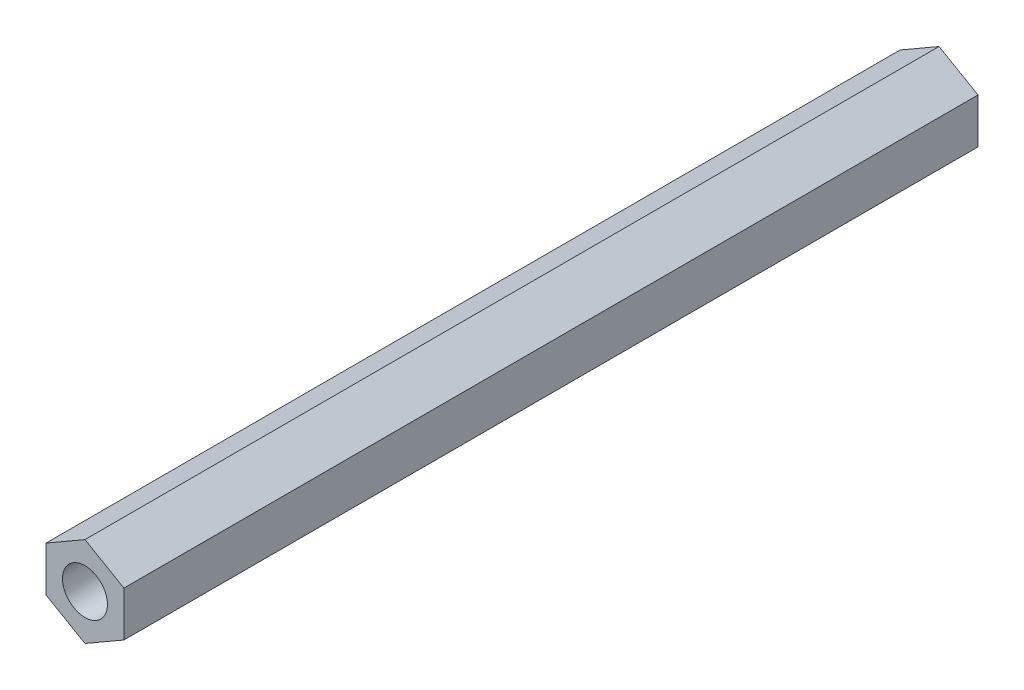
ISO-10303-21;
HEADER;
FILE_DESCRIPTION(('STEP AP214'),'2;1');
FILE_NAME('part.step','',(''),(''),'','','');
FILE_SCHEMA(('AUTOMOTIVE_DESIGN { 1 0 10303 214 1 1 1 1 }'));
ENDSEC;
DATA;
#1=APPLICATION_CONTEXT('core data for automotive mechanical design processes');
#2=APPLICATION_PROTOCOL_DEFINITION('international standard','automotive_design',2000,#1);
#3=PRODUCT_CONTEXT('',#1,'mechanical');
#4=PRODUCT('Part','Part','',(#3));
#5=PRODUCT_RELATED_PRODUCT_CATEGORY('part','',(#4));
#6=PRODUCT_DEFINITION_FORMATION('','',#4);
#7=PRODUCT_DEFINITION_CONTEXT('part definition',#1,'design');
#8=PRODUCT_DEFINITION('design','',#6,#7);
#9=PRODUCT_DEFINITION_SHAPE('','',#8);
#10=(LENGTH_UNIT() NAMED_UNIT(*) SI_UNIT(.MILLI.,.METRE.));
#11=(NAMED_UNIT(*) PLANE_ANGLE_UNIT() SI_UNIT($,.RADIAN.));
#12=(NAMED_UNIT(*) SI_UNIT($,.STERADIAN.) SOLID_ANGLE_UNIT());
#13=UNCERTAINTY_MEASURE_WITH_UNIT(LENGTH_MEASURE(1.E-05),#10,'distance_accuracy_value','');
#14=(GEOMETRIC_REPRESENTATION_CONTEXT(3) GLOBAL_UNCERTAINTY_ASSIGNED_CONTEXT((#13)) GLOBAL_UNIT_ASSIGNED_CONTEXT((#10,
#11,#12)) REPRESENTATION_CONTEXT('',''));
#15=CARTESIAN_POINT('',(0.,0.,0.));
#16=DIRECTION('',(0.,0.,1.));
#17=DIRECTION('',(1.,0.,0.));
#18=AXIS2_PLACEMENT_3D('',#15,#16,#17);
#19=CARTESIAN_POINT('',(-2.6,1.50111069989303,57.));
#20=DIRECTION('',(1.,0.,0.));
#21=DIRECTION('',(0.,0.,-1.));
#22=AXIS2_PLACEMENT_3D('',#19,#20,#21);
#23=PLANE('',#22);
#24=DIRECTION('',(0.,-1.,0.));
#25=VECTOR('',#24,1.);
#26=CARTESIAN_POINT('',(-2.6,1.50111069989303,0.));
#27=LINE('',#26,#25);
#28=CARTESIAN_POINT('',(-2.6,1.50111069989303,0.));
#29=VERTEX_POINT('',#28);
#30=CARTESIAN_POINT('',(-2.6,-1.50111069989303,0.));
#31=VERTEX_POINT('',#30);
#32=EDGE_CURVE('E111',#29,#31,#27,.T.);
#33=ORIENTED_EDGE('',*,*,#32,.T.);
#34=DIRECTION('',(0.,0.,-1.));
#35=VECTOR('',#34,1.);
#36=CARTESIAN_POINT('',(-2.6,-1.50111069989303,57.));
#37=LINE('',#36,#35);
#38=CARTESIAN_POINT('',(-2.6,-1.50111069989303,57.));
#39=VERTEX_POINT('',#38);
#40=EDGE_CURVE('E9',#39,#31,#37,.T.);
#41=ORIENTED_EDGE('',*,*,#40,.F.);
#42=DIRECTION('',(0.,-1.,0.));
#43=VECTOR('',#42,1.);
#44=CARTESIAN_POINT('',(-2.6,1.50111069989303,57.));
#45=LINE('',#44,#43);
#46=CARTESIAN_POINT('',(-2.6,1.50111069989303,57.));
#47=VERTEX_POINT('',#46);
#48=EDGE_CURVE('E131',#47,#39,#45,.T.);
#49=ORIENTED_EDGE('',*,*,#48,.F.);
#50=DIRECTION('',(0.,0.,-1.));
#51=VECTOR('',#50,1.);
#52=CARTESIAN_POINT('',(-2.6,1.50111069989303,57.));
#53=LINE('',#52,#51);
#54=EDGE_CURVE('E18',#47,#29,#53,.T.);
#55=ORIENTED_EDGE('',*,*,#54,.T.);
#56=EDGE_LOOP('',(#33,#41,#49,#55));
#57=FACE_BOUND('',#56,.T.);
#58=ADVANCED_FACE('F15',(#57),#23,.F.);
#59=CARTESIAN_POINT('',(-2.6,-1.50111069989302,57.));
#60=DIRECTION('',(0.5,0.866025403784437,0.));
#61=DIRECTION('',(-0.866025403784437,0.5,0.));
#62=AXIS2_PLACEMENT_3D('',#59,#60,#61);
#63=PLANE('',#62);
#64=DIRECTION('',(0.866025403784437,-0.5,0.));
#65=VECTOR('',#64,1.);
#66=CARTESIAN_POINT('',(-2.6,-1.50111069989302,0.));
#67=LINE('',#66,#65);
#68=CARTESIAN_POINT('',(0.,-3.00222139978606,0.));
#69=VERTEX_POINT('',#68);
#70=EDGE_CURVE('E115',#31,#69,#67,.T.);
#71=ORIENTED_EDGE('',*,*,#70,.T.);
#72=DIRECTION('',(0.,0.,-1.));
#73=VECTOR('',#72,1.);
#74=CARTESIAN_POINT('',(0.,-3.00222139978606,57.));
#75=LINE('',#74,#73);
#76=CARTESIAN_POINT('',(0.,-3.00222139978606,57.));
#77=VERTEX_POINT('',#76);
#78=EDGE_CURVE('E25',#77,#69,#75,.T.);
#79=ORIENTED_EDGE('',*,*,#78,.F.);
#80=DIRECTION('',(0.866025403784437,-0.5,0.));
#81=VECTOR('',#80,1.);
#82=CARTESIAN_POINT('',(-2.6,-1.50111069989302,57.));
#83=LINE('',#82,#81);
#84=EDGE_CURVE('E83',#39,#77,#83,.T.);
#85=ORIENTED_EDGE('',*,*,#84,.F.);
#86=ORIENTED_EDGE('',*,*,#40,.T.);
#87=EDGE_LOOP('',(#71,#79,#85,#86));
#88=FACE_BOUND('',#87,.T.);
#89=ADVANCED_FACE('F312',(#88),#63,.F.);
#90=CARTESIAN_POINT('',(0.,-3.00222139978606,57.));
#91=DIRECTION('',(-0.5,0.866025403784441,0.));
#92=DIRECTION('',(-0.866025403784441,-0.5,0.));
#93=AXIS2_PLACEMENT_3D('',#90,#91,#92);
#94=PLANE('',#93);
#95=DIRECTION('',(0.866025403784441,0.5,0.));
#96=VECTOR('',#95,1.);
#97=CARTESIAN_POINT('',(0.,-3.00222139978606,0.));
#98=LINE('',#97,#96);
#99=CARTESIAN_POINT('',(2.6,-1.50111069989304,0.));
#100=VERTEX_POINT('',#99);
#101=EDGE_CURVE('E92',#69,#100,#98,.T.);
#102=ORIENTED_EDGE('',*,*,#101,.T.);
#103=DIRECTION('',(0.,0.,-1.));
#104=VECTOR('',#103,1.);
#105=CARTESIAN_POINT('',(2.6,-1.50111069989304,57.));
#106=LINE('',#105,#104);
#107=CARTESIAN_POINT('',(2.6,-1.50111069989304,57.));
#108=VERTEX_POINT('',#107);
#109=EDGE_CURVE('E89',#108,#100,#106,.T.);
#110=ORIENTED_EDGE('',*,*,#109,.F.);
#111=DIRECTION('',(0.866025403784441,0.5,0.));
#112=VECTOR('',#111,1.);
#113=CARTESIAN_POINT('',(0.,-3.00222139978606,57.));
#114=LINE('',#113,#112);
#115=EDGE_CURVE('E77',#77,#108,#114,.T.);
#116=ORIENTED_EDGE('',*,*,#115,.F.);
#117=ORIENTED_EDGE('',*,*,#78,.T.);
#118=EDGE_LOOP('',(#102,#110,#116,#117));
#119=FACE_BOUND('',#118,.T.);
#120=ADVANCED_FACE('F90',(#119),#94,.F.);
#121=CARTESIAN_POINT('',(2.6,-1.50111069989303,57.));
#122=DIRECTION('',(-1.,0.,0.));
#123=DIRECTION('',(0.,0.,1.));
#124=AXIS2_PLACEMENT_3D('',#121,#122,#123);
#125=PLANE('',#124);
#126=DIRECTION('',(0.,1.,0.));
#127=VECTOR('',#126,1.);
#128=CARTESIAN_POINT('',(2.6,-1.50111069989303,0.));
#129=LINE('',#128,#127);
#130=CARTESIAN_POINT('',(2.6,1.50111069989303,0.));
#131=VERTEX_POINT('',#130);
#132=EDGE_CURVE('E56',#100,#131,#129,.T.);
#133=ORIENTED_EDGE('',*,*,#132,.T.);
#134=DIRECTION('',(0.,0.,-1.));
#135=VECTOR('',#134,1.);
#136=CARTESIAN_POINT('',(2.6,1.50111069989303,57.));
#137=LINE('',#136,#135);
#138=CARTESIAN_POINT('',(2.6,1.50111069989303,57.));
#139=VERTEX_POINT('',#138);
#140=EDGE_CURVE('E94',#139,#131,#137,.T.);
#141=ORIENTED_EDGE('',*,*,#140,.F.);
#142=DIRECTION('',(0.,1.,0.));
#143=VECTOR('',#142,1.);
#144=CARTESIAN_POINT('',(2.6,-1.50111069989303,57.));
#145=LINE('',#144,#143);
#146=EDGE_CURVE('E82',#108,#139,#145,.T.);
#147=ORIENTED_EDGE('',*,*,#146,.F.);
#148=ORIENTED_EDGE('',*,*,#109,.T.);
#149=EDGE_LOOP('',(#133,#141,#147,#148));
#150=FACE_BOUND('',#149,.T.);
#151=ADVANCED_FACE('F96',(#150),#125,.F.);
#152=CARTESIAN_POINT('',(2.6,1.50111069989303,57.));
#153=DIRECTION('',(-0.5,-0.866025403784438,0.));
#154=DIRECTION('',(0.866025403784438,-0.5,0.));
#155=AXIS2_PLACEMENT_3D('',#152,#153,#154);
#156=PLANE('',#155);
#157=DIRECTION('',(-0.866025403784438,0.5,0.));
#158=VECTOR('',#157,1.);
#159=CARTESIAN_POINT('',(2.6,1.50111069989303,0.));
#160=LINE('',#159,#158);
#161=CARTESIAN_POINT('',(0.,3.00222139978606,0.));
#162=VERTEX_POINT('',#161);
#163=EDGE_CURVE('E62',#131,#162,#160,.T.);
#164=ORIENTED_EDGE('',*,*,#163,.T.);
#165=DIRECTION('',(0.,0.,-1.));
#166=VECTOR('',#165,1.);
#167=CARTESIAN_POINT('',(0.,3.00222139978606,57.));
#168=LINE('',#167,#166);
#169=CARTESIAN_POINT('',(0.,3.00222139978606,57.));
#170=VERTEX_POINT('',#169);
#171=EDGE_CURVE('E132',#170,#162,#168,.T.);
#172=ORIENTED_EDGE('',*,*,#171,.F.);
#173=DIRECTION('',(-0.866025403784438,0.5,0.));
#174=VECTOR('',#173,1.);
#175=CARTESIAN_POINT('',(2.6,1.50111069989303,57.));
#176=LINE('',#175,#174);
#177=EDGE_CURVE('E33',#139,#170,#176,.T.);
#178=ORIENTED_EDGE('',*,*,#177,.F.);
#179=ORIENTED_EDGE('',*,*,#140,.T.);
#180=EDGE_LOOP('',(#164,#172,#178,#179));
#181=FACE_BOUND('',#180,.T.);
#182=ADVANCED_FACE('F284',(#181),#156,.F.);
#183=CARTESIAN_POINT('',(0.,3.00222139978606,57.));
#184=DIRECTION('',(0.5,-0.866025403784439,0.));
#185=DIRECTION('',(0.86602540378444,0.5,0.));
#186=AXIS2_PLACEMENT_3D('',#183,#184,#185);
#187=PLANE('',#186);
#188=DIRECTION('',(-0.866025403784439,-0.5,0.));
#189=VECTOR('',#188,1.);
#190=CARTESIAN_POINT('',(0.,3.00222139978606,0.));
#191=LINE('',#190,#189);
#192=EDGE_CURVE('E124',#162,#29,#191,.T.);
#193=ORIENTED_EDGE('',*,*,#192,.T.);
#194=ORIENTED_EDGE('',*,*,#54,.F.);
#195=DIRECTION('',(-0.866025403784439,-0.5,0.));
#196=VECTOR('',#195,1.);
#197=CARTESIAN_POINT('',(0.,3.00222139978606,57.));
#198=LINE('',#197,#196);
#199=EDGE_CURVE('E68',#170,#47,#198,.T.);
#200=ORIENTED_EDGE('',*,*,#199,.F.);
#201=ORIENTED_EDGE('',*,*,#171,.T.);
#202=EDGE_LOOP('',(#193,#194,#200,#201));
#203=FACE_BOUND('',#202,.T.);
#204=ADVANCED_FACE('F147',(#203),#187,.F.);
#205=CARTESIAN_POINT('',(0.,0.,57.));
#206=DIRECTION('',(0.,0.,-1.));
#207=DIRECTION('',(-1.,0.,0.));
#208=AXIS2_PLACEMENT_3D('',#205,#206,#207);
#209=CYLINDRICAL_SURFACE('',#208,1.5);
#210=CARTESIAN_POINT('',(0.,0.,57.));
#211=DIRECTION('',(0.,0.,1.));
#212=DIRECTION('',(1.,0.,0.));
#213=AXIS2_PLACEMENT_3D('',#210,#211,#212);
#214=CIRCLE('',#213,1.5);
#215=CARTESIAN_POINT('',(1.5,0.,57.));
#216=VERTEX_POINT('',#215);
#217=EDGE_CURVE('E107',#216,#216,#214,.T.);
#218=ORIENTED_EDGE('',*,*,#217,.T.);
#219=EDGE_LOOP('',(#218));
#220=FACE_BOUND('',#219,.T.);
#221=CARTESIAN_POINT('',(0.,0.,0.));
#222=DIRECTION('',(0.,0.,1.));
#223=DIRECTION('',(1.,0.,0.));
#224=AXIS2_PLACEMENT_3D('',#221,#222,#223);
#225=CIRCLE('',#224,1.5);
#226=CARTESIAN_POINT('',(1.5,0.,0.));
#227=VERTEX_POINT('',#226);
#228=EDGE_CURVE('E127',#227,#227,#225,.T.);
#229=ORIENTED_EDGE('',*,*,#228,.F.);
#230=EDGE_LOOP('',(#229));
#231=FACE_BOUND('',#230,.T.);
#232=ADVANCED_FACE('F260',(#220,#231),#209,.F.);
#233=CARTESIAN_POINT('',(0.,0.,57.));
#234=DIRECTION('',(0.,0.,1.));
#235=DIRECTION('',(1.,0.,0.));
#236=AXIS2_PLACEMENT_3D('',#233,#234,#235);
#237=PLANE('',#236);
#238=ORIENTED_EDGE('',*,*,#48,.T.);
#239=ORIENTED_EDGE('',*,*,#84,.T.);
#240=ORIENTED_EDGE('',*,*,#115,.T.);
#241=ORIENTED_EDGE('',*,*,#146,.T.);
#242=ORIENTED_EDGE('',*,*,#177,.T.);
#243=ORIENTED_EDGE('',*,*,#199,.T.);
#244=EDGE_LOOP('',(#238,#239,#240,#241,#242,#243));
#245=FACE_BOUND('',#244,.T.);
#246=ORIENTED_EDGE('',*,*,#217,.F.);
#247=EDGE_LOOP('',(#246));
#248=FACE_BOUND('',#247,.T.);
#249=ADVANCED_FACE('F79',(#245,#248),#237,.T.);
#250=CARTESIAN_POINT('',(0.,0.,0.));
#251=DIRECTION('',(0.,0.,1.));
#252=DIRECTION('',(1.,0.,0.));
#253=AXIS2_PLACEMENT_3D('',#250,#251,#252);
#254=PLANE('',#253);
#255=ORIENTED_EDGE('',*,*,#32,.F.);
#256=ORIENTED_EDGE('',*,*,#192,.F.);
#257=ORIENTED_EDGE('',*,*,#163,.F.);
#258=ORIENTED_EDGE('',*,*,#132,.F.);
#259=ORIENTED_EDGE('',*,*,#101,.F.);
#260=ORIENTED_EDGE('',*,*,#70,.F.);
#261=EDGE_LOOP('',(#255,#256,#257,#258,#259,#260));
#262=FACE_BOUND('',#261,.T.);
#263=ORIENTED_EDGE('',*,*,#228,.T.);
#264=EDGE_LOOP('',(#263));
#265=FACE_BOUND('',#264,.T.);
#266=ADVANCED_FACE('F142',(#262,#265),#254,.F.);
#267=CLOSED_SHELL('',(#58,#89,#120,#151,#182,#204,#232,#249,#266));
#268=MANIFOLD_SOLID_BREP('B1',#267);
#269=ADVANCED_BREP_SHAPE_REPRESENTATION('',(#18,#268),#14);
#270=SHAPE_DEFINITION_REPRESENTATION(#9,#269);
ENDSEC;
END-ISO-10303-21;
